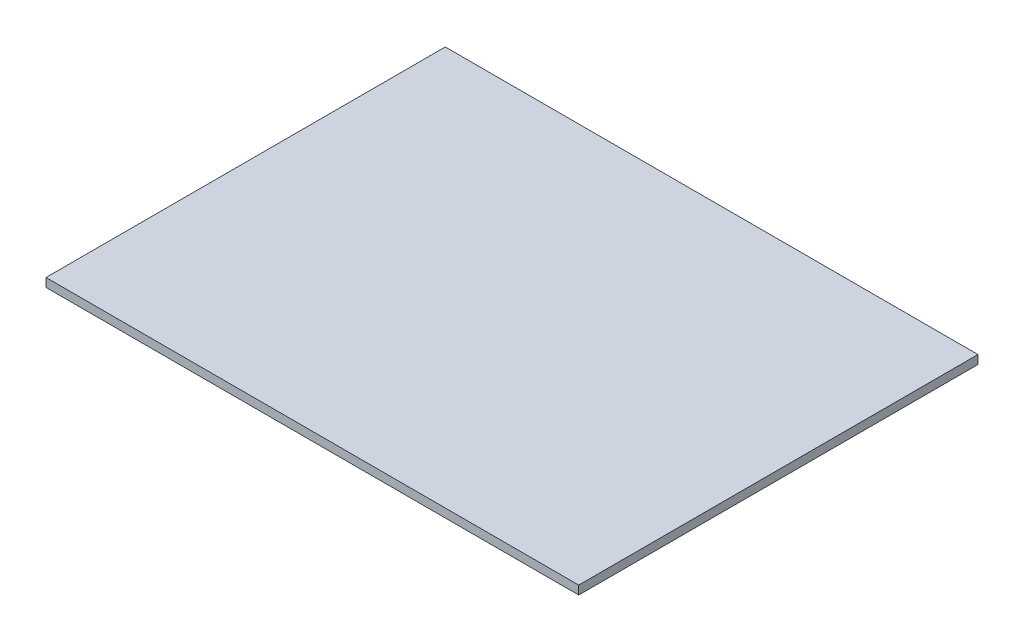
ISO-10303-21;
HEADER;
FILE_DESCRIPTION(('STEP AP214'),'2;1');
FILE_NAME('part.step','',(''),(''),'','','');
FILE_SCHEMA(('AUTOMOTIVE_DESIGN { 1 0 10303 214 1 1 1 1 }'));
ENDSEC;
DATA;
#1=APPLICATION_CONTEXT('core data for automotive mechanical design processes');
#2=APPLICATION_PROTOCOL_DEFINITION('international standard','automotive_design',2000,#1);
#3=PRODUCT_CONTEXT('',#1,'mechanical');
#4=PRODUCT('Part','Part','',(#3));
#5=PRODUCT_RELATED_PRODUCT_CATEGORY('part','',(#4));
#6=PRODUCT_DEFINITION_FORMATION('','',#4);
#7=PRODUCT_DEFINITION_CONTEXT('part definition',#1,'design');
#8=PRODUCT_DEFINITION('design','',#6,#7);
#9=PRODUCT_DEFINITION_SHAPE('','',#8);
#10=(LENGTH_UNIT() NAMED_UNIT(*) SI_UNIT(.MILLI.,.METRE.));
#11=(NAMED_UNIT(*) PLANE_ANGLE_UNIT() SI_UNIT($,.RADIAN.));
#12=(NAMED_UNIT(*) SI_UNIT($,.STERADIAN.) SOLID_ANGLE_UNIT());
#13=UNCERTAINTY_MEASURE_WITH_UNIT(LENGTH_MEASURE(1.E-05),#10,'distance_accuracy_value','');
#14=(GEOMETRIC_REPRESENTATION_CONTEXT(3) GLOBAL_UNCERTAINTY_ASSIGNED_CONTEXT((#13)) GLOBAL_UNIT_ASSIGNED_CONTEXT((#10,
#11,#12)) REPRESENTATION_CONTEXT('',''));
#15=CARTESIAN_POINT('',(0.,0.,0.));
#16=DIRECTION('',(0.,0.,1.));
#17=DIRECTION('',(1.,0.,0.));
#18=AXIS2_PLACEMENT_3D('',#15,#16,#17);
#19=CARTESIAN_POINT('',(-2054.28382931457,50.,-1678.22941176471));
#20=DIRECTION('',(1.,0.,0.));
#21=DIRECTION('',(0.,0.,-1.));
#22=AXIS2_PLACEMENT_3D('',#19,#20,#21);
#23=PLANE('',#22);
#24=DIRECTION('',(0.,0.,1.));
#25=VECTOR('',#24,1.);
#26=CARTESIAN_POINT('',(-2054.28382931457,0.,-1678.22941176471));
#27=LINE('',#26,#25);
#28=CARTESIAN_POINT('',(-2054.28382931457,0.,-1678.22941176471));
#29=VERTEX_POINT('',#28);
#30=CARTESIAN_POINT('',(-2054.28382931457,0.,628.770588235294));
#31=VERTEX_POINT('',#30);
#32=EDGE_CURVE('E107',#29,#31,#27,.T.);
#33=ORIENTED_EDGE('',*,*,#32,.T.);
#34=DIRECTION('',(0.,-1.,0.));
#35=VECTOR('',#34,1.);
#36=CARTESIAN_POINT('',(-2054.28382931457,50.,628.770588235294));
#37=LINE('',#36,#35);
#38=CARTESIAN_POINT('',(-2054.28382931457,50.,628.770588235294));
#39=VERTEX_POINT('',#38);
#40=EDGE_CURVE('E11',#39,#31,#37,.T.);
#41=ORIENTED_EDGE('',*,*,#40,.F.);
#42=DIRECTION('',(0.,0.,1.));
#43=VECTOR('',#42,1.);
#44=CARTESIAN_POINT('',(-2054.28382931457,50.,-1678.22941176471));
#45=LINE('',#44,#43);
#46=CARTESIAN_POINT('',(-2054.28382931457,50.,-1678.22941176471));
#47=VERTEX_POINT('',#46);
#48=EDGE_CURVE('E91',#47,#39,#45,.T.);
#49=ORIENTED_EDGE('',*,*,#48,.F.);
#50=DIRECTION('',(0.,-1.,0.));
#51=VECTOR('',#50,1.);
#52=CARTESIAN_POINT('',(-2054.28382931457,50.,-1678.22941176471));
#53=LINE('',#52,#51);
#54=EDGE_CURVE('E103',#47,#29,#53,.T.);
#55=ORIENTED_EDGE('',*,*,#54,.T.);
#56=EDGE_LOOP('',(#33,#41,#49,#55));
#57=FACE_BOUND('',#56,.T.);
#58=ADVANCED_FACE('F39',(#57),#23,.F.);
#59=CARTESIAN_POINT('',(-2054.28382931457,50.,628.770588235294));
#60=DIRECTION('',(0.,0.,-1.));
#61=DIRECTION('',(-1.,0.,0.));
#62=AXIS2_PLACEMENT_3D('',#59,#60,#61);
#63=PLANE('',#62);
#64=DIRECTION('',(1.,0.,0.));
#65=VECTOR('',#64,1.);
#66=CARTESIAN_POINT('',(-2054.28382931457,0.,628.770588235294));
#67=LINE('',#66,#65);
#68=CARTESIAN_POINT('',(1023.71617068543,0.,628.770588235294));
#69=VERTEX_POINT('',#68);
#70=EDGE_CURVE('E96',#31,#69,#67,.T.);
#71=ORIENTED_EDGE('',*,*,#70,.T.);
#72=DIRECTION('',(0.,-1.,0.));
#73=VECTOR('',#72,1.);
#74=CARTESIAN_POINT('',(1023.71617068543,50.,628.770588235294));
#75=LINE('',#74,#73);
#76=CARTESIAN_POINT('',(1023.71617068543,50.,628.770588235294));
#77=VERTEX_POINT('',#76);
#78=EDGE_CURVE('E48',#77,#69,#75,.T.);
#79=ORIENTED_EDGE('',*,*,#78,.F.);
#80=DIRECTION('',(1.,0.,0.));
#81=VECTOR('',#80,1.);
#82=CARTESIAN_POINT('',(-2054.28382931457,50.,628.770588235294));
#83=LINE('',#82,#81);
#84=EDGE_CURVE('E86',#39,#77,#83,.T.);
#85=ORIENTED_EDGE('',*,*,#84,.F.);
#86=ORIENTED_EDGE('',*,*,#40,.T.);
#87=EDGE_LOOP('',(#71,#79,#85,#86));
#88=FACE_BOUND('',#87,.T.);
#89=ADVANCED_FACE('F95',(#88),#63,.F.);
#90=CARTESIAN_POINT('',(1023.71617068542,50.,-1678.22941176471));
#91=DIRECTION('',(-1.,0.,0.));
#92=DIRECTION('',(0.,0.,1.));
#93=AXIS2_PLACEMENT_3D('',#90,#91,#92);
#94=PLANE('',#93);
#95=DIRECTION('',(0.,0.,-1.));
#96=VECTOR('',#95,1.);
#97=CARTESIAN_POINT('',(1023.71617068542,0.,-1678.22941176471));
#98=LINE('',#97,#96);
#99=CARTESIAN_POINT('',(1023.71617068542,0.,-1678.22941176471));
#100=VERTEX_POINT('',#99);
#101=EDGE_CURVE('E73',#69,#100,#98,.T.);
#102=ORIENTED_EDGE('',*,*,#101,.T.);
#103=DIRECTION('',(0.,-1.,0.));
#104=VECTOR('',#103,1.);
#105=CARTESIAN_POINT('',(1023.71617068542,50.,-1678.22941176471));
#106=LINE('',#105,#104);
#107=CARTESIAN_POINT('',(1023.71617068542,50.,-1678.22941176471));
#108=VERTEX_POINT('',#107);
#109=EDGE_CURVE('E98',#108,#100,#106,.T.);
#110=ORIENTED_EDGE('',*,*,#109,.F.);
#111=DIRECTION('',(0.,0.,-1.));
#112=VECTOR('',#111,1.);
#113=CARTESIAN_POINT('',(1023.71617068542,50.,-1678.22941176471));
#114=LINE('',#113,#112);
#115=EDGE_CURVE('E89',#77,#108,#114,.T.);
#116=ORIENTED_EDGE('',*,*,#115,.F.);
#117=ORIENTED_EDGE('',*,*,#78,.T.);
#118=EDGE_LOOP('',(#102,#110,#116,#117));
#119=FACE_BOUND('',#118,.T.);
#120=ADVANCED_FACE('F99',(#119),#94,.F.);
#121=CARTESIAN_POINT('',(-2054.28382931457,50.,-1678.22941176471));
#122=DIRECTION('',(0.,0.,1.));
#123=DIRECTION('',(1.,0.,0.));
#124=AXIS2_PLACEMENT_3D('',#121,#122,#123);
#125=PLANE('',#124);
#126=DIRECTION('',(-1.,0.,0.));
#127=VECTOR('',#126,1.);
#128=CARTESIAN_POINT('',(-2054.28382931457,0.,-1678.22941176471));
#129=LINE('',#128,#127);
#130=EDGE_CURVE('E79',#100,#29,#129,.T.);
#131=ORIENTED_EDGE('',*,*,#130,.T.);
#132=ORIENTED_EDGE('',*,*,#54,.F.);
#133=DIRECTION('',(-1.,0.,0.));
#134=VECTOR('',#133,1.);
#135=CARTESIAN_POINT('',(-2054.28382931457,50.,-1678.22941176471));
#136=LINE('',#135,#134);
#137=EDGE_CURVE('E56',#108,#47,#136,.T.);
#138=ORIENTED_EDGE('',*,*,#137,.F.);
#139=ORIENTED_EDGE('',*,*,#109,.T.);
#140=EDGE_LOOP('',(#131,#132,#138,#139));
#141=FACE_BOUND('',#140,.T.);
#142=ADVANCED_FACE('F120',(#141),#125,.F.);
#143=CARTESIAN_POINT('',(0.,50.,0.));
#144=DIRECTION('',(0.,1.,0.));
#145=DIRECTION('',(0.,0.,1.));
#146=AXIS2_PLACEMENT_3D('',#143,#144,#145);
#147=PLANE('',#146);
#148=ORIENTED_EDGE('',*,*,#48,.T.);
#149=ORIENTED_EDGE('',*,*,#84,.T.);
#150=ORIENTED_EDGE('',*,*,#115,.T.);
#151=ORIENTED_EDGE('',*,*,#137,.T.);
#152=EDGE_LOOP('',(#148,#149,#150,#151));
#153=FACE_BOUND('',#152,.T.);
#154=ADVANCED_FACE('F87',(#153),#147,.T.);
#155=CARTESIAN_POINT('',(0.,0.,0.));
#156=DIRECTION('',(0.,1.,0.));
#157=DIRECTION('',(0.,0.,1.));
#158=AXIS2_PLACEMENT_3D('',#155,#156,#157);
#159=PLANE('',#158);
#160=ORIENTED_EDGE('',*,*,#32,.F.);
#161=ORIENTED_EDGE('',*,*,#130,.F.);
#162=ORIENTED_EDGE('',*,*,#101,.F.);
#163=ORIENTED_EDGE('',*,*,#70,.F.);
#164=EDGE_LOOP('',(#160,#161,#162,#163));
#165=FACE_BOUND('',#164,.T.);
#166=ADVANCED_FACE('F123',(#165),#159,.F.);
#167=CLOSED_SHELL('',(#58,#89,#120,#142,#154,#166));
#168=MANIFOLD_SOLID_BREP('B2',#167);
#169=ADVANCED_BREP_SHAPE_REPRESENTATION('',(#18,#168),#14);
#170=SHAPE_DEFINITION_REPRESENTATION(#9,#169);
ENDSEC;
END-ISO-10303-21;
